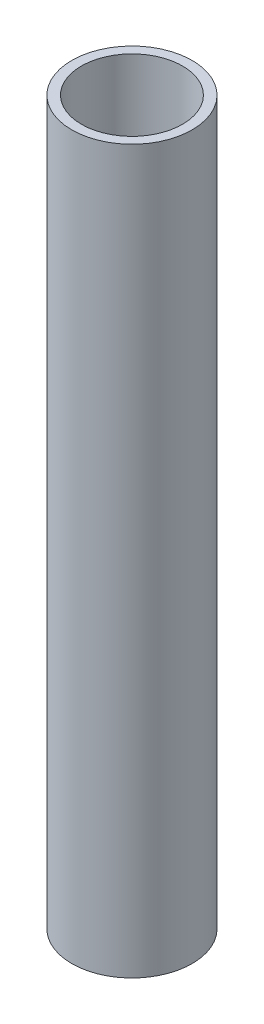
ISO-10303-21;
HEADER;
FILE_DESCRIPTION(('STEP AP214'),'2;1');
FILE_NAME('part.step','',(''),(''),'','','');
FILE_SCHEMA(('AUTOMOTIVE_DESIGN { 1 0 10303 214 1 1 1 1 }'));
ENDSEC;
DATA;
#1=APPLICATION_CONTEXT('core data for automotive mechanical design processes');
#2=APPLICATION_PROTOCOL_DEFINITION('international standard','automotive_design',2000,#1);
#3=PRODUCT_CONTEXT('',#1,'mechanical');
#4=PRODUCT('Part','Part','',(#3));
#5=PRODUCT_RELATED_PRODUCT_CATEGORY('part','',(#4));
#6=PRODUCT_DEFINITION_FORMATION('','',#4);
#7=PRODUCT_DEFINITION_CONTEXT('part definition',#1,'design');
#8=PRODUCT_DEFINITION('design','',#6,#7);
#9=PRODUCT_DEFINITION_SHAPE('','',#8);
#10=(LENGTH_UNIT() NAMED_UNIT(*) SI_UNIT(.MILLI.,.METRE.));
#11=(NAMED_UNIT(*) PLANE_ANGLE_UNIT() SI_UNIT($,.RADIAN.));
#12=(NAMED_UNIT(*) SI_UNIT($,.STERADIAN.) SOLID_ANGLE_UNIT());
#13=UNCERTAINTY_MEASURE_WITH_UNIT(LENGTH_MEASURE(1.E-05),#10,'distance_accuracy_value','');
#14=(GEOMETRIC_REPRESENTATION_CONTEXT(3) GLOBAL_UNCERTAINTY_ASSIGNED_CONTEXT((#13)) GLOBAL_UNIT_ASSIGNED_CONTEXT((#10,
#11,#12)) REPRESENTATION_CONTEXT('',''));
#15=CARTESIAN_POINT('',(0.,0.,0.));
#16=DIRECTION('',(0.,0.,1.));
#17=DIRECTION('',(1.,0.,0.));
#18=AXIS2_PLACEMENT_3D('',#15,#16,#17);
#19=CARTESIAN_POINT('',(0.,19.05,0.));
#20=DIRECTION('',(0.,-1.,0.));
#21=DIRECTION('',(0.,0.,-1.));
#22=AXIS2_PLACEMENT_3D('',#19,#20,#21);
#23=CYLINDRICAL_SURFACE('',#22,3.175);
#24=CARTESIAN_POINT('',(0.,19.05,0.));
#25=DIRECTION('',(0.,1.,0.));
#26=DIRECTION('',(0.,0.,1.));
#27=AXIS2_PLACEMENT_3D('',#24,#25,#26);
#28=CIRCLE('',#27,3.175);
#29=CARTESIAN_POINT('',(0.,19.05,3.175));
#30=VERTEX_POINT('',#29);
#31=EDGE_CURVE('E10',#30,#30,#28,.T.);
#32=ORIENTED_EDGE('',*,*,#31,.F.);
#33=EDGE_LOOP('',(#32));
#34=FACE_BOUND('',#33,.T.);
#35=CARTESIAN_POINT('',(0.,-19.05,0.));
#36=DIRECTION('',(0.,1.,0.));
#37=DIRECTION('',(0.,0.,1.));
#38=AXIS2_PLACEMENT_3D('',#35,#36,#37);
#39=CIRCLE('',#38,3.175);
#40=CARTESIAN_POINT('',(0.,-19.05,3.175));
#41=VERTEX_POINT('',#40);
#42=EDGE_CURVE('E34',#41,#41,#39,.T.);
#43=ORIENTED_EDGE('',*,*,#42,.T.);
#44=EDGE_LOOP('',(#43));
#45=FACE_BOUND('',#44,.T.);
#46=ADVANCED_FACE('F31',(#34,#45),#23,.T.);
#47=CARTESIAN_POINT('',(0.,19.05,0.));
#48=DIRECTION('',(0.,1.,0.));
#49=DIRECTION('',(0.,0.,1.));
#50=AXIS2_PLACEMENT_3D('',#47,#48,#49);
#51=PLANE('',#50);
#52=CARTESIAN_POINT('',(0.,19.05,0.));
#53=DIRECTION('',(0.,1.,0.));
#54=DIRECTION('',(0.,0.,1.));
#55=AXIS2_PLACEMENT_3D('',#52,#53,#54);
#56=CIRCLE('',#55,2.667);
#57=CARTESIAN_POINT('',(0.,19.05,2.667));
#58=VERTEX_POINT('',#57);
#59=EDGE_CURVE('E45',#58,#58,#56,.T.);
#60=ORIENTED_EDGE('',*,*,#59,.F.);
#61=EDGE_LOOP('',(#60));
#62=FACE_BOUND('',#61,.T.);
#63=ORIENTED_EDGE('',*,*,#31,.T.);
#64=EDGE_LOOP('',(#63));
#65=FACE_BOUND('',#64,.T.);
#66=ADVANCED_FACE('F51',(#62,#65),#51,.T.);
#67=CARTESIAN_POINT('',(0.,-19.05,0.));
#68=DIRECTION('',(0.,1.,0.));
#69=DIRECTION('',(0.,0.,1.));
#70=AXIS2_PLACEMENT_3D('',#67,#68,#69);
#71=PLANE('',#70);
#72=CARTESIAN_POINT('',(0.,-19.05,0.));
#73=DIRECTION('',(0.,1.,0.));
#74=DIRECTION('',(0.,0.,1.));
#75=AXIS2_PLACEMENT_3D('',#72,#73,#74);
#76=CIRCLE('',#75,2.667);
#77=CARTESIAN_POINT('',(0.,-19.05,2.667));
#78=VERTEX_POINT('',#77);
#79=EDGE_CURVE('E41',#78,#78,#76,.T.);
#80=ORIENTED_EDGE('',*,*,#79,.T.);
#81=EDGE_LOOP('',(#80));
#82=FACE_BOUND('',#81,.T.);
#83=ORIENTED_EDGE('',*,*,#42,.F.);
#84=EDGE_LOOP('',(#83));
#85=FACE_BOUND('',#84,.T.);
#86=ADVANCED_FACE('F53',(#82,#85),#71,.F.);
#87=CARTESIAN_POINT('',(0.,-19.05,0.));
#88=DIRECTION('',(0.,1.,0.));
#89=DIRECTION('',(0.,0.,1.));
#90=AXIS2_PLACEMENT_3D('',#87,#88,#89);
#91=CYLINDRICAL_SURFACE('',#90,2.667);
#92=ORIENTED_EDGE('',*,*,#79,.F.);
#93=EDGE_LOOP('',(#92));
#94=FACE_BOUND('',#93,.T.);
#95=ORIENTED_EDGE('',*,*,#59,.T.);
#96=EDGE_LOOP('',(#95));
#97=FACE_BOUND('',#96,.T.);
#98=ADVANCED_FACE('F49',(#94,#97),#91,.F.);
#99=CLOSED_SHELL('',(#46,#66,#86,#98));
#100=MANIFOLD_SOLID_BREP('B2',#99);
#101=ADVANCED_BREP_SHAPE_REPRESENTATION('',(#18,#100),#14);
#102=SHAPE_DEFINITION_REPRESENTATION(#9,#101);
ENDSEC;
END-ISO-10303-21;
